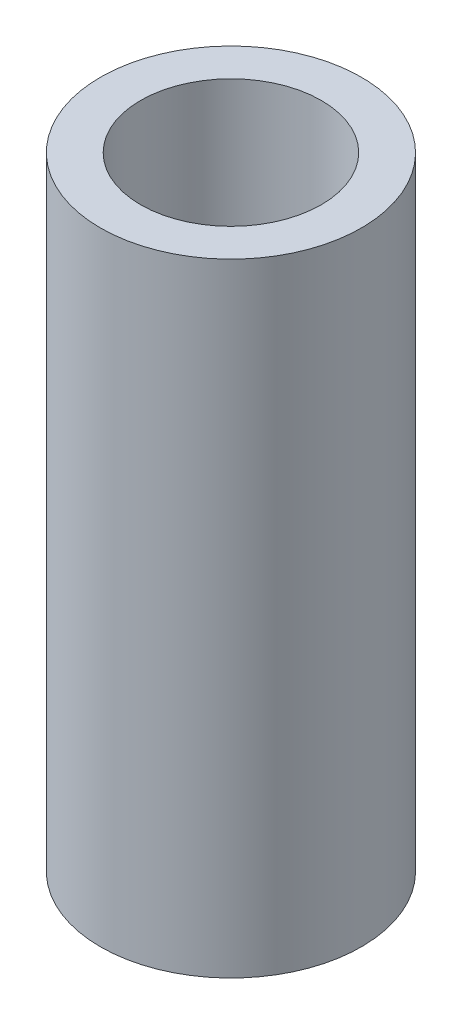
ISO-10303-21;
HEADER;
FILE_DESCRIPTION(('STEP AP214'),'2;1');
FILE_NAME('part.step','',(''),(''),'','','');
FILE_SCHEMA(('AUTOMOTIVE_DESIGN { 1 0 10303 214 1 1 1 1 }'));
ENDSEC;
DATA;
#1=APPLICATION_CONTEXT('core data for automotive mechanical design processes');
#2=APPLICATION_PROTOCOL_DEFINITION('international standard','automotive_design',2000,#1);
#3=PRODUCT_CONTEXT('',#1,'mechanical');
#4=PRODUCT('Part','Part','',(#3));
#5=PRODUCT_RELATED_PRODUCT_CATEGORY('part','',(#4));
#6=PRODUCT_DEFINITION_FORMATION('','',#4);
#7=PRODUCT_DEFINITION_CONTEXT('part definition',#1,'design');
#8=PRODUCT_DEFINITION('design','',#6,#7);
#9=PRODUCT_DEFINITION_SHAPE('','',#8);
#10=(LENGTH_UNIT() NAMED_UNIT(*) SI_UNIT(.MILLI.,.METRE.));
#11=(NAMED_UNIT(*) PLANE_ANGLE_UNIT() SI_UNIT($,.RADIAN.));
#12=(NAMED_UNIT(*) SI_UNIT($,.STERADIAN.) SOLID_ANGLE_UNIT());
#13=UNCERTAINTY_MEASURE_WITH_UNIT(LENGTH_MEASURE(1.E-05),#10,'distance_accuracy_value','');
#14=(GEOMETRIC_REPRESENTATION_CONTEXT(3) GLOBAL_UNCERTAINTY_ASSIGNED_CONTEXT((#13)) GLOBAL_UNIT_ASSIGNED_CONTEXT((#10,
#11,#12)) REPRESENTATION_CONTEXT('',''));
#15=CARTESIAN_POINT('',(0.,0.,0.));
#16=DIRECTION('',(0.,0.,1.));
#17=DIRECTION('',(1.,0.,0.));
#18=AXIS2_PLACEMENT_3D('',#15,#16,#17);
#19=CARTESIAN_POINT('',(0.,15.5,0.));
#20=DIRECTION('',(0.,1.,0.));
#21=DIRECTION('',(0.,0.,1.));
#22=AXIS2_PLACEMENT_3D('',#19,#20,#21);
#23=PLANE('',#22);
#24=CARTESIAN_POINT('',(0.,15.5,0.));
#25=DIRECTION('',(0.,1.,0.));
#26=DIRECTION('',(0.,0.,1.));
#27=AXIS2_PLACEMENT_3D('',#24,#25,#26);
#28=CIRCLE('',#27,3.25);
#29=CARTESIAN_POINT('',(0.,15.5,3.25));
#30=VERTEX_POINT('',#29);
#31=EDGE_CURVE('E10',#30,#30,#28,.T.);
#32=ORIENTED_EDGE('',*,*,#31,.T.);
#33=EDGE_LOOP('',(#32));
#34=FACE_BOUND('',#33,.T.);
#35=CARTESIAN_POINT('',(0.,15.5,0.));
#36=DIRECTION('',(0.,1.,0.));
#37=DIRECTION('',(0.,0.,1.));
#38=AXIS2_PLACEMENT_3D('',#35,#36,#37);
#39=CIRCLE('',#38,2.25);
#40=CARTESIAN_POINT('',(0.,15.5,2.25));
#41=VERTEX_POINT('',#40);
#42=EDGE_CURVE('E45',#41,#41,#39,.T.);
#43=ORIENTED_EDGE('',*,*,#42,.F.);
#44=EDGE_LOOP('',(#43));
#45=FACE_BOUND('',#44,.T.);
#46=ADVANCED_FACE('F34',(#34,#45),#23,.T.);
#47=CARTESIAN_POINT('',(0.,0.,0.));
#48=DIRECTION('',(0.,1.,0.));
#49=DIRECTION('',(0.,0.,1.));
#50=AXIS2_PLACEMENT_3D('',#47,#48,#49);
#51=PLANE('',#50);
#52=CARTESIAN_POINT('',(0.,0.,0.));
#53=DIRECTION('',(0.,1.,0.));
#54=DIRECTION('',(0.,0.,1.));
#55=AXIS2_PLACEMENT_3D('',#52,#53,#54);
#56=CIRCLE('',#55,3.25);
#57=CARTESIAN_POINT('',(0.,0.,3.25));
#58=VERTEX_POINT('',#57);
#59=EDGE_CURVE('E38',#58,#58,#56,.T.);
#60=ORIENTED_EDGE('',*,*,#59,.F.);
#61=EDGE_LOOP('',(#60));
#62=FACE_BOUND('',#61,.T.);
#63=CARTESIAN_POINT('',(0.,0.,0.));
#64=DIRECTION('',(0.,1.,0.));
#65=DIRECTION('',(0.,0.,1.));
#66=AXIS2_PLACEMENT_3D('',#63,#64,#65);
#67=CIRCLE('',#66,2.25);
#68=CARTESIAN_POINT('',(0.,0.,2.25));
#69=VERTEX_POINT('',#68);
#70=EDGE_CURVE('E47',#69,#69,#67,.T.);
#71=ORIENTED_EDGE('',*,*,#70,.T.);
#72=EDGE_LOOP('',(#71));
#73=FACE_BOUND('',#72,.T.);
#74=ADVANCED_FACE('F57',(#62,#73),#51,.F.);
#75=CARTESIAN_POINT('',(0.,15.5,0.));
#76=DIRECTION('',(0.,-1.,0.));
#77=DIRECTION('',(0.,0.,-1.));
#78=AXIS2_PLACEMENT_3D('',#75,#76,#77);
#79=CYLINDRICAL_SURFACE('',#78,3.25);
#80=ORIENTED_EDGE('',*,*,#31,.F.);
#81=EDGE_LOOP('',(#80));
#82=FACE_BOUND('',#81,.T.);
#83=ORIENTED_EDGE('',*,*,#59,.T.);
#84=EDGE_LOOP('',(#83));
#85=FACE_BOUND('',#84,.T.);
#86=ADVANCED_FACE('F36',(#82,#85),#79,.T.);
#87=CARTESIAN_POINT('',(0.,15.5,0.));
#88=DIRECTION('',(0.,-1.,0.));
#89=DIRECTION('',(0.,0.,-1.));
#90=AXIS2_PLACEMENT_3D('',#87,#88,#89);
#91=CYLINDRICAL_SURFACE('',#90,2.25);
#92=ORIENTED_EDGE('',*,*,#42,.T.);
#93=EDGE_LOOP('',(#92));
#94=FACE_BOUND('',#93,.T.);
#95=ORIENTED_EDGE('',*,*,#70,.F.);
#96=EDGE_LOOP('',(#95));
#97=FACE_BOUND('',#96,.T.);
#98=ADVANCED_FACE('F53',(#94,#97),#91,.F.);
#99=CLOSED_SHELL('',(#46,#74,#86,#98));
#100=MANIFOLD_SOLID_BREP('B2',#99);
#101=ADVANCED_BREP_SHAPE_REPRESENTATION('',(#18,#100),#14);
#102=SHAPE_DEFINITION_REPRESENTATION(#9,#101);
ENDSEC;
END-ISO-10303-21;
